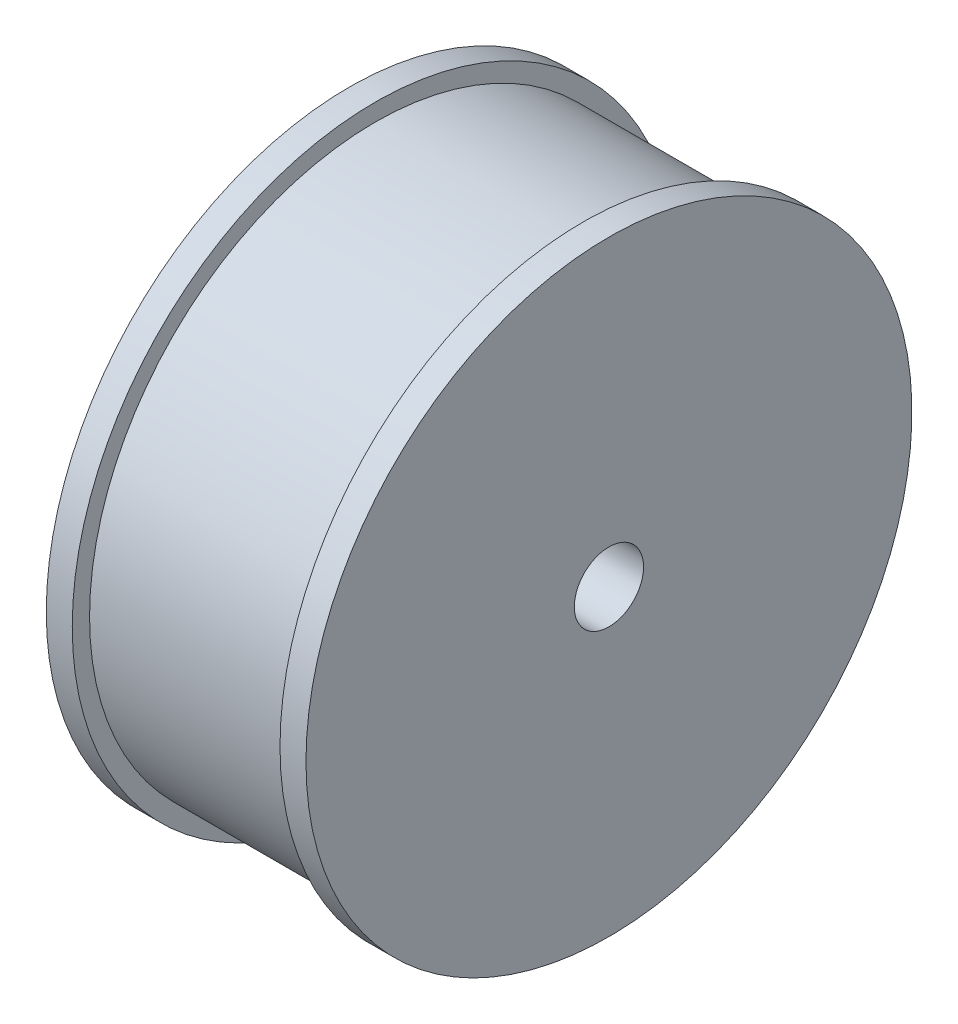
ISO-10303-21;
HEADER;
FILE_DESCRIPTION(('STEP AP214'),'2;1');
FILE_NAME('part.step','',(''),(''),'','','');
FILE_SCHEMA(('AUTOMOTIVE_DESIGN { 1 0 10303 214 1 1 1 1 }'));
ENDSEC;
DATA;
#1=APPLICATION_CONTEXT('core data for automotive mechanical design processes');
#2=APPLICATION_PROTOCOL_DEFINITION('international standard','automotive_design',2000,#1);
#3=PRODUCT_CONTEXT('',#1,'mechanical');
#4=PRODUCT('Part','Part','',(#3));
#5=PRODUCT_RELATED_PRODUCT_CATEGORY('part','',(#4));
#6=PRODUCT_DEFINITION_FORMATION('','',#4);
#7=PRODUCT_DEFINITION_CONTEXT('part definition',#1,'design');
#8=PRODUCT_DEFINITION('design','',#6,#7);
#9=PRODUCT_DEFINITION_SHAPE('','',#8);
#10=(LENGTH_UNIT() NAMED_UNIT(*) SI_UNIT(.MILLI.,.METRE.));
#11=(NAMED_UNIT(*) PLANE_ANGLE_UNIT() SI_UNIT($,.RADIAN.));
#12=(NAMED_UNIT(*) SI_UNIT($,.STERADIAN.) SOLID_ANGLE_UNIT());
#13=UNCERTAINTY_MEASURE_WITH_UNIT(LENGTH_MEASURE(1.E-05),#10,'distance_accuracy_value','');
#14=(GEOMETRIC_REPRESENTATION_CONTEXT(3) GLOBAL_UNCERTAINTY_ASSIGNED_CONTEXT((#13)) GLOBAL_UNIT_ASSIGNED_CONTEXT((#10,
#11,#12)) REPRESENTATION_CONTEXT('',''));
#15=CARTESIAN_POINT('',(0.,0.,0.));
#16=DIRECTION('',(0.,0.,1.));
#17=DIRECTION('',(1.,0.,0.));
#18=AXIS2_PLACEMENT_3D('',#15,#16,#17);
#19=CARTESIAN_POINT('',(15.,0.,0.));
#20=DIRECTION('',(-1.,0.,0.));
#21=DIRECTION('',(0.,0.,1.));
#22=AXIS2_PLACEMENT_3D('',#19,#20,#21);
#23=PLANE('',#22);
#24=CARTESIAN_POINT('',(15.,0.,0.));
#25=DIRECTION('',(1.,0.,0.));
#26=DIRECTION('',(0.,0.,-1.));
#27=AXIS2_PLACEMENT_3D('',#24,#25,#26);
#28=CIRCLE('',#27,4.);
#29=CARTESIAN_POINT('',(15.,0.,-4.));
#30=VERTEX_POINT('',#29);
#31=EDGE_CURVE('E87',#30,#30,#28,.T.);
#32=ORIENTED_EDGE('',*,*,#31,.F.);
#33=EDGE_LOOP('',(#32));
#34=FACE_BOUND('',#33,.T.);
#35=CARTESIAN_POINT('',(15.,0.,0.));
#36=DIRECTION('',(-1.,0.,0.));
#37=DIRECTION('',(0.,0.,1.));
#38=AXIS2_PLACEMENT_3D('',#35,#36,#37);
#39=CIRCLE('',#38,35.);
#40=CARTESIAN_POINT('',(15.,0.,35.));
#41=VERTEX_POINT('',#40);
#42=EDGE_CURVE('E40',#41,#41,#39,.T.);
#43=ORIENTED_EDGE('',*,*,#42,.F.);
#44=EDGE_LOOP('',(#43));
#45=FACE_BOUND('',#44,.T.);
#46=ADVANCED_FACE('F37',(#34,#45),#23,.F.);
#47=CARTESIAN_POINT('',(-15.,0.,0.));
#48=DIRECTION('',(-1.,0.,0.));
#49=DIRECTION('',(0.,0.,1.));
#50=AXIS2_PLACEMENT_3D('',#47,#48,#49);
#51=CYLINDRICAL_SURFACE('',#50,35.);
#52=CARTESIAN_POINT('',(12.,0.,0.));
#53=DIRECTION('',(-1.,0.,0.));
#54=DIRECTION('',(0.,0.,1.));
#55=AXIS2_PLACEMENT_3D('',#52,#53,#54);
#56=CIRCLE('',#55,35.);
#57=CARTESIAN_POINT('',(12.,0.,35.));
#58=VERTEX_POINT('',#57);
#59=EDGE_CURVE('E50',#58,#58,#56,.T.);
#60=ORIENTED_EDGE('',*,*,#59,.F.);
#61=EDGE_LOOP('',(#60));
#62=FACE_BOUND('',#61,.T.);
#63=ORIENTED_EDGE('',*,*,#42,.T.);
#64=EDGE_LOOP('',(#63));
#65=FACE_BOUND('',#64,.T.);
#66=ADVANCED_FACE('F76',(#62,#65),#51,.T.);
#67=CARTESIAN_POINT('',(12.,35.,0.));
#68=DIRECTION('',(1.,0.,0.));
#69=DIRECTION('',(0.,0.,-1.));
#70=AXIS2_PLACEMENT_3D('',#67,#68,#69);
#71=PLANE('',#70);
#72=CARTESIAN_POINT('',(12.,0.,0.));
#73=DIRECTION('',(-1.,0.,0.));
#74=DIRECTION('',(0.,0.,1.));
#75=AXIS2_PLACEMENT_3D('',#72,#73,#74);
#76=CIRCLE('',#75,33.);
#77=CARTESIAN_POINT('',(12.,0.,33.));
#78=VERTEX_POINT('',#77);
#79=EDGE_CURVE('E67',#78,#78,#76,.T.);
#80=ORIENTED_EDGE('',*,*,#79,.F.);
#81=EDGE_LOOP('',(#80));
#82=FACE_BOUND('',#81,.T.);
#83=ORIENTED_EDGE('',*,*,#59,.T.);
#84=EDGE_LOOP('',(#83));
#85=FACE_BOUND('',#84,.T.);
#86=ADVANCED_FACE('F74',(#82,#85),#71,.F.);
#87=CARTESIAN_POINT('',(-15.,0.,0.));
#88=DIRECTION('',(-1.,0.,0.));
#89=DIRECTION('',(0.,0.,1.));
#90=AXIS2_PLACEMENT_3D('',#87,#88,#89);
#91=CYLINDRICAL_SURFACE('',#90,33.);
#92=CARTESIAN_POINT('',(-12.,0.,0.));
#93=DIRECTION('',(-1.,0.,0.));
#94=DIRECTION('',(0.,0.,1.));
#95=AXIS2_PLACEMENT_3D('',#92,#93,#94);
#96=CIRCLE('',#95,33.);
#97=CARTESIAN_POINT('',(-12.,0.,33.));
#98=VERTEX_POINT('',#97);
#99=EDGE_CURVE('E63',#98,#98,#96,.T.);
#100=ORIENTED_EDGE('',*,*,#99,.F.);
#101=EDGE_LOOP('',(#100));
#102=FACE_BOUND('',#101,.T.);
#103=ORIENTED_EDGE('',*,*,#79,.T.);
#104=EDGE_LOOP('',(#103));
#105=FACE_BOUND('',#104,.T.);
#106=ADVANCED_FACE('F123',(#102,#105),#91,.T.);
#107=CARTESIAN_POINT('',(-12.,35.,0.));
#108=DIRECTION('',(-1.,0.,0.));
#109=DIRECTION('',(0.,0.,1.));
#110=AXIS2_PLACEMENT_3D('',#107,#108,#109);
#111=PLANE('',#110);
#112=CARTESIAN_POINT('',(-12.,0.,0.));
#113=DIRECTION('',(-1.,0.,0.));
#114=DIRECTION('',(0.,0.,1.));
#115=AXIS2_PLACEMENT_3D('',#112,#113,#114);
#116=CIRCLE('',#115,35.);
#117=CARTESIAN_POINT('',(-12.,0.,35.));
#118=VERTEX_POINT('',#117);
#119=EDGE_CURVE('E59',#118,#118,#116,.T.);
#120=ORIENTED_EDGE('',*,*,#119,.F.);
#121=EDGE_LOOP('',(#120));
#122=FACE_BOUND('',#121,.T.);
#123=ORIENTED_EDGE('',*,*,#99,.T.);
#124=EDGE_LOOP('',(#123));
#125=FACE_BOUND('',#124,.T.);
#126=ADVANCED_FACE('F119',(#122,#125),#111,.F.);
#127=CARTESIAN_POINT('',(-15.,0.,0.));
#128=DIRECTION('',(-1.,0.,0.));
#129=DIRECTION('',(0.,0.,1.));
#130=AXIS2_PLACEMENT_3D('',#127,#128,#129);
#131=CYLINDRICAL_SURFACE('',#130,35.);
#132=CARTESIAN_POINT('',(-15.,0.,0.));
#133=DIRECTION('',(-1.,0.,0.));
#134=DIRECTION('',(0.,0.,1.));
#135=AXIS2_PLACEMENT_3D('',#132,#133,#134);
#136=CIRCLE('',#135,35.);
#137=CARTESIAN_POINT('',(-15.,0.,35.));
#138=VERTEX_POINT('',#137);
#139=EDGE_CURVE('E55',#138,#138,#136,.T.);
#140=ORIENTED_EDGE('',*,*,#139,.F.);
#141=EDGE_LOOP('',(#140));
#142=FACE_BOUND('',#141,.T.);
#143=ORIENTED_EDGE('',*,*,#119,.T.);
#144=EDGE_LOOP('',(#143));
#145=FACE_BOUND('',#144,.T.);
#146=ADVANCED_FACE('F112',(#142,#145),#131,.T.);
#147=CARTESIAN_POINT('',(-15.,0.,0.));
#148=DIRECTION('',(1.,0.,0.));
#149=DIRECTION('',(0.,0.,-1.));
#150=AXIS2_PLACEMENT_3D('',#147,#148,#149);
#151=PLANE('',#150);
#152=CARTESIAN_POINT('',(-15.,0.,0.));
#153=DIRECTION('',(-1.,0.,0.));
#154=DIRECTION('',(0.,0.,1.));
#155=AXIS2_PLACEMENT_3D('',#152,#153,#154);
#156=CIRCLE('',#155,10.);
#157=CARTESIAN_POINT('',(-15.,0.,10.));
#158=VERTEX_POINT('',#157);
#159=EDGE_CURVE('E10',#158,#158,#156,.T.);
#160=ORIENTED_EDGE('',*,*,#159,.F.);
#161=EDGE_LOOP('',(#160));
#162=FACE_BOUND('',#161,.T.);
#163=ORIENTED_EDGE('',*,*,#139,.T.);
#164=EDGE_LOOP('',(#163));
#165=FACE_BOUND('',#164,.T.);
#166=ADVANCED_FACE('F104',(#162,#165),#151,.F.);
#167=CARTESIAN_POINT('',(-23.,0.,0.));
#168=DIRECTION('',(1.,0.,0.));
#169=DIRECTION('',(0.,0.,-1.));
#170=AXIS2_PLACEMENT_3D('',#167,#168,#169);
#171=CYLINDRICAL_SURFACE('',#170,10.);
#172=CARTESIAN_POINT('',(-23.,0.,0.));
#173=DIRECTION('',(-1.,0.,0.));
#174=DIRECTION('',(0.,0.,1.));
#175=AXIS2_PLACEMENT_3D('',#172,#173,#174);
#176=CIRCLE('',#175,10.);
#177=CARTESIAN_POINT('',(-23.,0.,10.));
#178=VERTEX_POINT('',#177);
#179=EDGE_CURVE('E53',#178,#178,#176,.T.);
#180=ORIENTED_EDGE('',*,*,#179,.F.);
#181=EDGE_LOOP('',(#180));
#182=FACE_BOUND('',#181,.T.);
#183=ORIENTED_EDGE('',*,*,#159,.T.);
#184=EDGE_LOOP('',(#183));
#185=FACE_BOUND('',#184,.T.);
#186=ADVANCED_FACE('F102',(#182,#185),#171,.T.);
#187=CARTESIAN_POINT('',(-23.,0.,0.));
#188=DIRECTION('',(-1.,0.,0.));
#189=DIRECTION('',(0.,0.,1.));
#190=AXIS2_PLACEMENT_3D('',#187,#188,#189);
#191=PLANE('',#190);
#192=CARTESIAN_POINT('',(-23.,0.,0.));
#193=DIRECTION('',(-1.,0.,0.));
#194=DIRECTION('',(0.,0.,1.));
#195=AXIS2_PLACEMENT_3D('',#192,#193,#194);
#196=CIRCLE('',#195,4.);
#197=CARTESIAN_POINT('',(-23.,0.,4.));
#198=VERTEX_POINT('',#197);
#199=EDGE_CURVE('E90',#198,#198,#196,.F.);
#200=ORIENTED_EDGE('',*,*,#199,.T.);
#201=EDGE_LOOP('',(#200));
#202=FACE_BOUND('',#201,.T.);
#203=ORIENTED_EDGE('',*,*,#179,.T.);
#204=EDGE_LOOP('',(#203));
#205=FACE_BOUND('',#204,.T.);
#206=ADVANCED_FACE('F100',(#202,#205),#191,.T.);
#207=CARTESIAN_POINT('',(-34.3137084989848,0.,0.));
#208=DIRECTION('',(1.,0.,0.));
#209=DIRECTION('',(0.,0.,-1.));
#210=AXIS2_PLACEMENT_3D('',#207,#208,#209);
#211=CYLINDRICAL_SURFACE('',#210,4.);
#212=ORIENTED_EDGE('',*,*,#31,.T.);
#213=EDGE_LOOP('',(#212));
#214=FACE_BOUND('',#213,.T.);
#215=ORIENTED_EDGE('',*,*,#199,.F.);
#216=EDGE_LOOP('',(#215));
#217=FACE_BOUND('',#216,.T.);
#218=ADVANCED_FACE('F110',(#214,#217),#211,.F.);
#219=CLOSED_SHELL('',(#46,#66,#86,#106,#126,#146,#166,#186,#206,#218));
#220=MANIFOLD_SOLID_BREP('B2',#219);
#221=ADVANCED_BREP_SHAPE_REPRESENTATION('',(#18,#220),#14);
#222=SHAPE_DEFINITION_REPRESENTATION(#9,#221);
ENDSEC;
END-ISO-10303-21;
